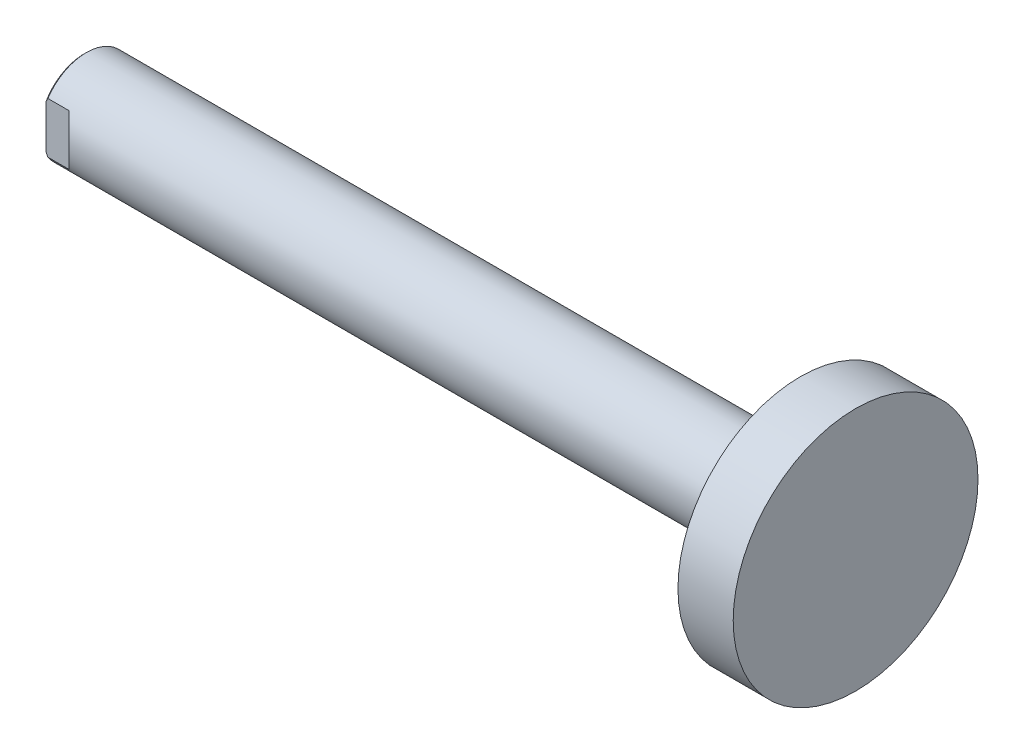
ISO-10303-21;
HEADER;
FILE_DESCRIPTION(('STEP AP214'),'2;1');
FILE_NAME('part.step','',(''),(''),'','','');
FILE_SCHEMA(('AUTOMOTIVE_DESIGN { 1 0 10303 214 1 1 1 1 }'));
ENDSEC;
DATA;
#1=APPLICATION_CONTEXT('core data for automotive mechanical design processes');
#2=APPLICATION_PROTOCOL_DEFINITION('international standard','automotive_design',2000,#1);
#3=PRODUCT_CONTEXT('',#1,'mechanical');
#4=PRODUCT('Part','Part','',(#3));
#5=PRODUCT_RELATED_PRODUCT_CATEGORY('part','',(#4));
#6=PRODUCT_DEFINITION_FORMATION('','',#4);
#7=PRODUCT_DEFINITION_CONTEXT('part definition',#1,'design');
#8=PRODUCT_DEFINITION('design','',#6,#7);
#9=PRODUCT_DEFINITION_SHAPE('','',#8);
#10=(LENGTH_UNIT() NAMED_UNIT(*) SI_UNIT(.MILLI.,.METRE.));
#11=(NAMED_UNIT(*) PLANE_ANGLE_UNIT() SI_UNIT($,.RADIAN.));
#12=(NAMED_UNIT(*) SI_UNIT($,.STERADIAN.) SOLID_ANGLE_UNIT());
#13=UNCERTAINTY_MEASURE_WITH_UNIT(LENGTH_MEASURE(1.E-05),#10,'distance_accuracy_value','');
#14=(GEOMETRIC_REPRESENTATION_CONTEXT(3) GLOBAL_UNCERTAINTY_ASSIGNED_CONTEXT((#13)) GLOBAL_UNIT_ASSIGNED_CONTEXT((#10,
#11,#12)) REPRESENTATION_CONTEXT('',''));
#15=CARTESIAN_POINT('',(0.,0.,0.));
#16=DIRECTION('',(0.,0.,1.));
#17=DIRECTION('',(1.,0.,0.));
#18=AXIS2_PLACEMENT_3D('',#15,#16,#17);
#19=CARTESIAN_POINT('',(7.40000000001828,0.,0.));
#20=DIRECTION('',(-1.,0.,0.));
#21=DIRECTION('',(0.,0.,1.));
#22=AXIS2_PLACEMENT_3D('',#19,#20,#21);
#23=CONICAL_SURFACE('',#22,2.45849999998882,1.04719755119439);
#24=CARTESIAN_POINT('',(8.81941563682176,0.,0.));
#25=VERTEX_POINT('',#24);
#26=VERTEX_LOOP('',#25);
#27=FACE_BOUND('',#26,.T.);
#28=CARTESIAN_POINT('',(7.4,0.,0.));
#29=DIRECTION('',(-1.,0.,0.));
#30=DIRECTION('',(0.,-1.,0.));
#31=AXIS2_PLACEMENT_3D('',#28,#29,#30);
#32=CIRCLE('',#31,2.4585);
#33=CARTESIAN_POINT('',(7.4,-2.4585,0.));
#34=VERTEX_POINT('',#33);
#35=EDGE_CURVE('E112',#34,#34,#32,.T.);
#36=ORIENTED_EDGE('',*,*,#35,.T.);
#37=EDGE_LOOP('',(#36));
#38=FACE_BOUND('',#37,.T.);
#39=ADVANCED_FACE('F16',(#27,#38),#23,.F.);
#40=CARTESIAN_POINT('',(8.8194156368027,0.,0.));
#41=DIRECTION('',(-1.,0.,0.));
#42=DIRECTION('',(0.,-1.,0.));
#43=AXIS2_PLACEMENT_3D('',#40,#41,#42);
#44=CYLINDRICAL_SURFACE('',#43,2.4585);
#45=CARTESIAN_POINT('',(-6.45850000006476,0.,0.));
#46=DIRECTION('',(-1.,0.,0.));
#47=DIRECTION('',(0.,-1.,0.));
#48=AXIS2_PLACEMENT_3D('',#45,#46,#47);
#49=CIRCLE('',#48,2.45849999998882);
#50=CARTESIAN_POINT('',(-6.45850000006476,-2.45849999998882,0.));
#51=VERTEX_POINT('',#50);
#52=EDGE_CURVE('E109',#51,#51,#49,.T.);
#53=ORIENTED_EDGE('',*,*,#52,.T.);
#54=EDGE_LOOP('',(#53));
#55=FACE_BOUND('',#54,.T.);
#56=ORIENTED_EDGE('',*,*,#35,.F.);
#57=EDGE_LOOP('',(#56));
#58=FACE_BOUND('',#57,.T.);
#59=ADVANCED_FACE('F176',(#55,#58),#44,.F.);
#60=CARTESIAN_POINT('',(93.5,15.95,0.));
#61=DIRECTION('',(-1.,0.,0.));
#62=DIRECTION('',(0.,0.,1.));
#63=AXIS2_PLACEMENT_3D('',#60,#61,#62);
#64=PLANE('',#63);
#65=CARTESIAN_POINT('',(93.5,0.,0.));
#66=DIRECTION('',(-1.,0.,0.));
#67=DIRECTION('',(0.,0.,1.));
#68=AXIS2_PLACEMENT_3D('',#65,#66,#67);
#69=CIRCLE('',#68,15.95);
#70=CARTESIAN_POINT('',(93.5,0.,15.95));
#71=VERTEX_POINT('',#70);
#72=EDGE_CURVE('E19',#71,#71,#69,.T.);
#73=ORIENTED_EDGE('',*,*,#72,.F.);
#74=EDGE_LOOP('',(#73));
#75=FACE_BOUND('',#74,.T.);
#76=ADVANCED_FACE('F173',(#75),#64,.F.);
#77=CARTESIAN_POINT('',(-7.000000000005,0.,0.));
#78=DIRECTION('',(-1.,0.,0.));
#79=DIRECTION('',(0.,0.,1.));
#80=AXIS2_PLACEMENT_3D('',#77,#78,#79);
#81=CONICAL_SURFACE('',#80,2.99999999992906,0.785398163397448);
#82=CARTESIAN_POINT('',(-7.000000000005,0.,0.));
#83=DIRECTION('',(-1.,0.,0.));
#84=DIRECTION('',(0.,0.,1.));
#85=AXIS2_PLACEMENT_3D('',#82,#83,#84);
#86=CIRCLE('',#85,2.99999999992906);
#87=CARTESIAN_POINT('',(-7.000000000005,0.,2.99999999992906));
#88=VERTEX_POINT('',#87);
#89=EDGE_CURVE('E201',#88,#88,#86,.T.);
#90=ORIENTED_EDGE('',*,*,#89,.T.);
#91=EDGE_LOOP('',(#90));
#92=FACE_BOUND('',#91,.T.);
#93=ORIENTED_EDGE('',*,*,#52,.F.);
#94=EDGE_LOOP('',(#93));
#95=FACE_BOUND('',#94,.T.);
#96=ADVANCED_FACE('F169',(#92,#95),#81,.F.);
#97=CARTESIAN_POINT('',(93.5,0.,0.));
#98=DIRECTION('',(-1.,0.,0.));
#99=DIRECTION('',(0.,0.,1.));
#100=AXIS2_PLACEMENT_3D('',#97,#98,#99);
#101=CYLINDRICAL_SURFACE('',#100,15.95);
#102=CARTESIAN_POINT('',(86.3,0.,0.));
#103=DIRECTION('',(-1.,0.,0.));
#104=DIRECTION('',(0.,0.,1.));
#105=AXIS2_PLACEMENT_3D('',#102,#103,#104);
#106=CIRCLE('',#105,15.95);
#107=CARTESIAN_POINT('',(86.3,0.,15.95));
#108=VERTEX_POINT('',#107);
#109=EDGE_CURVE('E80',#108,#108,#106,.F.);
#110=ORIENTED_EDGE('',*,*,#109,.T.);
#111=EDGE_LOOP('',(#110));
#112=FACE_BOUND('',#111,.T.);
#113=ORIENTED_EDGE('',*,*,#72,.T.);
#114=EDGE_LOOP('',(#113));
#115=FACE_BOUND('',#114,.T.);
#116=ADVANCED_FACE('F165',(#112,#115),#101,.T.);
#117=CARTESIAN_POINT('',(-7.,0.,0.));
#118=DIRECTION('',(1.,0.,0.));
#119=DIRECTION('',(0.,0.,-1.));
#120=AXIS2_PLACEMENT_3D('',#117,#118,#119);
#121=PLANE('',#120);
#122=ORIENTED_EDGE('',*,*,#89,.F.);
#123=EDGE_LOOP('',(#122));
#124=FACE_BOUND('',#123,.T.);
#125=DIRECTION('',(0.,1.,0.));
#126=VECTOR('',#125,1.);
#127=CARTESIAN_POINT('',(-7.,10.,-5.));
#128=LINE('',#127,#126);
#129=CARTESIAN_POINT('',(-6.99999999997408,-2.83945417291763,-5.));
#130=VERTEX_POINT('',#129);
#131=CARTESIAN_POINT('',(-6.99999999997408,2.83945417291763,-5.));
#132=VERTEX_POINT('',#131);
#133=EDGE_CURVE('E76',#130,#132,#128,.T.);
#134=ORIENTED_EDGE('',*,*,#133,.F.);
#135=CARTESIAN_POINT('',(-6.99999999994816,0.,0.));
#136=DIRECTION('',(1.,0.,0.));
#137=DIRECTION('',(0.,0.,-1.));
#138=AXIS2_PLACEMENT_3D('',#135,#136,#137);
#139=CIRCLE('',#138,5.75000000003456);
#140=CARTESIAN_POINT('',(-6.99999999996544,-2.83945417293513,5.));
#141=VERTEX_POINT('',#140);
#142=EDGE_CURVE('E69',#141,#130,#139,.T.);
#143=ORIENTED_EDGE('',*,*,#142,.F.);
#144=DIRECTION('',(0.,1.,0.));
#145=VECTOR('',#144,1.);
#146=CARTESIAN_POINT('',(-7.,10.,5.));
#147=LINE('',#146,#145);
#148=CARTESIAN_POINT('',(-6.99999999997408,2.83945417291763,5.));
#149=VERTEX_POINT('',#148);
#150=EDGE_CURVE('E74',#149,#141,#147,.F.);
#151=ORIENTED_EDGE('',*,*,#150,.F.);
#152=CARTESIAN_POINT('',(-6.99999999994816,0.,0.));
#153=DIRECTION('',(1.,0.,0.));
#154=DIRECTION('',(0.,0.,-1.));
#155=AXIS2_PLACEMENT_3D('',#152,#153,#154);
#156=CIRCLE('',#155,5.75000000003456);
#157=EDGE_CURVE('E89',#132,#149,#156,.T.);
#158=ORIENTED_EDGE('',*,*,#157,.F.);
#159=EDGE_LOOP('',(#134,#143,#151,#158));
#160=FACE_BOUND('',#159,.T.);
#161=ADVANCED_FACE('F71',(#124,#160),#121,.F.);
#162=CARTESIAN_POINT('',(86.3,6.,0.));
#163=DIRECTION('',(1.,0.,0.));
#164=DIRECTION('',(0.,0.,-1.));
#165=AXIS2_PLACEMENT_3D('',#162,#163,#164);
#166=PLANE('',#165);
#167=CARTESIAN_POINT('',(86.3,0.,0.));
#168=DIRECTION('',(-1.,0.,0.));
#169=DIRECTION('',(0.,0.,1.));
#170=AXIS2_PLACEMENT_3D('',#167,#168,#169);
#171=CIRCLE('',#170,6.);
#172=CARTESIAN_POINT('',(86.3,0.,6.));
#173=VERTEX_POINT('',#172);
#174=EDGE_CURVE('E93',#173,#173,#171,.T.);
#175=ORIENTED_EDGE('',*,*,#174,.F.);
#176=EDGE_LOOP('',(#175));
#177=FACE_BOUND('',#176,.T.);
#178=ORIENTED_EDGE('',*,*,#109,.F.);
#179=EDGE_LOOP('',(#178));
#180=FACE_BOUND('',#179,.T.);
#181=ADVANCED_FACE('F158',(#177,#180),#166,.F.);
#182=CARTESIAN_POINT('',(-6.75000000001091,0.,0.));
#183=DIRECTION('',(1.,0.,0.));
#184=DIRECTION('',(0.,0.,-1.));
#185=AXIS2_PLACEMENT_3D('',#182,#183,#184);
#186=CONICAL_SURFACE('',#185,5.99999999991496,0.785398163283761);
#187=CARTESIAN_POINT('',(-6.74999999995025,-3.3166247903279,-5.00000000001579));
#188=CARTESIAN_POINT('',(-6.77172046964819,-3.27733056165755,-5.0000000000057));
#189=CARTESIAN_POINT('',(-6.79323610499812,-3.23792278957236,-5.00000000000154));
#190=CARTESIAN_POINT('',(-6.83583018649129,-3.15887852904057,-4.99999999999847));
#191=CARTESIAN_POINT('',(-6.8569086906853,-3.11924207186846,-4.99999999999956));
#192=CARTESIAN_POINT('',(-6.89860699729288,-3.03972795186191,-5.00000000000044));
#193=CARTESIAN_POINT('',(-6.91922679555983,-2.99985028685113,-5.00000000000022));
#194=CARTESIAN_POINT('',(-6.95998326371193,-2.91984217525212,-4.99999999999978));
#195=CARTESIAN_POINT('',(-6.98011986864161,-2.87971169558349,-4.99999999999956));
#196=CARTESIAN_POINT('',(-6.99999999998277,-2.83945417290017,-5.));
#197=B_SPLINE_CURVE_WITH_KNOTS('',3,(#187,#188,#189,#190,#191,#192,#193,#194,#195,#196),
.UNSPECIFIED.,.F.,.F.,(4,2,2,2,4),(0.,0.134693282500561,0.269368561764464,0.40404505797675,
0.538739558403284),.UNSPECIFIED.);
#198=CARTESIAN_POINT('',(-6.74999999997161,-3.31662479033971,-5.));
#199=VERTEX_POINT('',#198);
#200=EDGE_CURVE('E104',#199,#130,#197,.T.);
#201=ORIENTED_EDGE('',*,*,#200,.F.);
#202=CARTESIAN_POINT('',(-6.75,0.,0.));
#203=DIRECTION('',(-1.,0.,0.));
#204=DIRECTION('',(0.,0.,1.));
#205=AXIS2_PLACEMENT_3D('',#202,#203,#204);
#206=CIRCLE('',#205,6.);
#207=CARTESIAN_POINT('',(-6.74999999997161,-3.31662479033971,5.));
#208=VERTEX_POINT('',#207);
#209=EDGE_CURVE('E86',#208,#199,#206,.F.);
#210=ORIENTED_EDGE('',*,*,#209,.F.);
#211=CARTESIAN_POINT('',(-6.99999999998272,-2.83945417290014,5.));
#212=CARTESIAN_POINT('',(-6.98011986864177,-2.87971169558361,5.));
#213=CARTESIAN_POINT('',(-6.959983263712,-2.91984217525221,5.));
#214=CARTESIAN_POINT('',(-6.9192267955597,-2.99985028685115,5.));
#215=CARTESIAN_POINT('',(-6.89860699729265,-3.03972795186188,5.));
#216=CARTESIAN_POINT('',(-6.85690869068543,-3.11924207186868,5.));
#217=CARTESIAN_POINT('',(-6.8358301864919,-3.15887852904109,5.));
#218=CARTESIAN_POINT('',(-6.79323610499732,-3.2379227895722,5.));
#219=CARTESIAN_POINT('',(-6.77172046964552,-3.27733056165642,5.));
#220=CARTESIAN_POINT('',(-6.74999999994307,-3.31662479032435,5.));
#221=B_SPLINE_CURVE_WITH_KNOTS('',3,(#211,#212,#213,#214,#215,#216,#217,#218,#219,#220),
.UNSPECIFIED.,.F.,.F.,(4,2,2,2,4),(0.,0.134694500426608,0.26937099663892,0.404046275902917,
0.538739558403616),.UNSPECIFIED.);
#222=EDGE_CURVE('E83',#141,#208,#221,.T.);
#223=ORIENTED_EDGE('',*,*,#222,.F.);
#224=ORIENTED_EDGE('',*,*,#142,.T.);
#225=EDGE_LOOP('',(#201,#210,#223,#224));
#226=FACE_BOUND('',#225,.T.);
#227=ADVANCED_FACE('F84',(#226),#186,.T.);
#228=CARTESIAN_POINT('',(-4.,10.,-5.));
#229=DIRECTION('',(-0.707106781186548,0.,-0.707106781186548));
#230=DIRECTION('',(-0.707106781186548,0.,0.707106781186548));
#231=AXIS2_PLACEMENT_3D('',#228,#229,#230);
#232=PLANE('',#231);
#233=CARTESIAN_POINT('',(-9.,0.,0.));
#234=DIRECTION('',(-0.707106781186548,0.,-0.707106781186548));
#235=DIRECTION('',(-0.707106781186548,0.,0.707106781186548));
#236=AXIS2_PLACEMENT_3D('',#233,#234,#235);
#237=ELLIPSE('',#236,8.48528137423857,6.);
#238=CARTESIAN_POINT('',(-4.,-3.3166247903554,-5.));
#239=VERTEX_POINT('',#238);
#240=CARTESIAN_POINT('',(-4.,3.3166247903554,-5.));
#241=VERTEX_POINT('',#240);
#242=EDGE_CURVE('E119',#239,#241,#237,.F.);
#243=ORIENTED_EDGE('',*,*,#242,.F.);
#244=DIRECTION('',(0.,1.,0.));
#245=VECTOR('',#244,1.);
#246=CARTESIAN_POINT('',(-4.,10.,-5.));
#247=LINE('',#246,#245);
#248=EDGE_CURVE('E79',#241,#239,#247,.F.);
#249=ORIENTED_EDGE('',*,*,#248,.F.);
#250=EDGE_LOOP('',(#243,#249));
#251=FACE_BOUND('',#250,.T.);
#252=ADVANCED_FACE('F157',(#251),#232,.T.);
#253=CARTESIAN_POINT('',(-7.,10.,-5.));
#254=DIRECTION('',(0.,0.,-1.));
#255=DIRECTION('',(-1.,0.,0.));
#256=AXIS2_PLACEMENT_3D('',#253,#254,#255);
#257=PLANE('',#256);
#258=ORIENTED_EDGE('',*,*,#200,.T.);
#259=ORIENTED_EDGE('',*,*,#133,.T.);
#260=CARTESIAN_POINT('',(-6.74999999994219,3.31662479032589,-5.));
#261=CARTESIAN_POINT('',(-6.77172046964462,3.27733056165803,-5.));
#262=CARTESIAN_POINT('',(-6.7932361049964,3.23792278957388,-5.));
#263=CARTESIAN_POINT('',(-6.83583018649093,3.1588785290429,-5.));
#264=CARTESIAN_POINT('',(-6.85690869068444,3.11924207187056,-5.));
#265=CARTESIAN_POINT('',(-6.8986069972916,3.03972795186389,-5.));
#266=CARTESIAN_POINT('',(-6.91922679555862,2.99985028685322,-5.));
#267=CARTESIAN_POINT('',(-6.95998326371089,2.91984217525443,-5.));
#268=CARTESIAN_POINT('',(-6.98011986864065,2.8797116955859,-5.));
#269=CARTESIAN_POINT('',(-6.99999999998161,2.83945417290251,-5.));
#270=B_SPLINE_CURVE_WITH_KNOTS('',3,(#260,#261,#262,#263,#264,#265,#266,#267,#268,#269),
.UNSPECIFIED.,.F.,.F.,(4,2,2,2,4),(0.,0.134693282500488,0.269368561764273,0.404045057976373,
0.538739558402769),.UNSPECIFIED.);
#271=CARTESIAN_POINT('',(-6.74999999997109,3.31662479034065,-5.));
#272=VERTEX_POINT('',#271);
#273=EDGE_CURVE('E103',#272,#132,#270,.T.);
#274=ORIENTED_EDGE('',*,*,#273,.F.);
#275=DIRECTION('',(-1.,0.,0.));
#276=VECTOR('',#275,1.);
#277=CARTESIAN_POINT('',(0.,3.3166247903554,-5.));
#278=LINE('',#277,#276);
#279=EDGE_CURVE('E101',#241,#272,#278,.T.);
#280=ORIENTED_EDGE('',*,*,#279,.F.);
#281=ORIENTED_EDGE('',*,*,#248,.T.);
#282=DIRECTION('',(-1.,0.,0.));
#283=VECTOR('',#282,1.);
#284=CARTESIAN_POINT('',(0.,-3.3166247903554,-5.));
#285=LINE('',#284,#283);
#286=EDGE_CURVE('E107',#199,#239,#285,.F.);
#287=ORIENTED_EDGE('',*,*,#286,.F.);
#288=EDGE_LOOP('',(#258,#259,#274,#280,#281,#287));
#289=FACE_BOUND('',#288,.T.);
#290=ADVANCED_FACE('F139',(#289),#257,.T.);
#291=CARTESIAN_POINT('',(-6.75000000001091,0.,0.));
#292=DIRECTION('',(1.,0.,0.));
#293=DIRECTION('',(0.,0.,-1.));
#294=AXIS2_PLACEMENT_3D('',#291,#292,#293);
#295=CONICAL_SURFACE('',#294,5.99999999991496,0.785398163283761);
#296=CARTESIAN_POINT('',(-6.74999999995025,3.3166247903279,5.00000000001579));
#297=CARTESIAN_POINT('',(-6.77172046964819,3.27733056165755,5.0000000000057));
#298=CARTESIAN_POINT('',(-6.79323610499812,3.23792278957236,5.00000000000154));
#299=CARTESIAN_POINT('',(-6.83583018649129,3.15887852904057,4.99999999999847));
#300=CARTESIAN_POINT('',(-6.8569086906853,3.11924207186846,4.99999999999956));
#301=CARTESIAN_POINT('',(-6.89860699729288,3.03972795186191,5.00000000000044));
#302=CARTESIAN_POINT('',(-6.91922679555983,2.99985028685113,5.00000000000022));
#303=CARTESIAN_POINT('',(-6.95998326371193,2.91984217525212,4.99999999999978));
#304=CARTESIAN_POINT('',(-6.98011986864161,2.87971169558349,4.99999999999956));
#305=CARTESIAN_POINT('',(-6.99999999998277,2.83945417290017,5.));
#306=B_SPLINE_CURVE_WITH_KNOTS('',3,(#296,#297,#298,#299,#300,#301,#302,#303,#304,#305),
.UNSPECIFIED.,.F.,.F.,(4,2,2,2,4),(0.,0.134693282500562,0.269368561764464,0.404045057976751,
0.538739558403285),.UNSPECIFIED.);
#307=CARTESIAN_POINT('',(-6.74999999997161,3.31662479033971,5.));
#308=VERTEX_POINT('',#307);
#309=EDGE_CURVE('E88',#308,#149,#306,.T.);
#310=ORIENTED_EDGE('',*,*,#309,.F.);
#311=CARTESIAN_POINT('',(-6.75,0.,0.));
#312=DIRECTION('',(-1.,0.,0.));
#313=DIRECTION('',(0.,0.,1.));
#314=AXIS2_PLACEMENT_3D('',#311,#312,#313);
#315=CIRCLE('',#314,6.);
#316=EDGE_CURVE('E98',#272,#308,#315,.F.);
#317=ORIENTED_EDGE('',*,*,#316,.F.);
#318=ORIENTED_EDGE('',*,*,#273,.T.);
#319=ORIENTED_EDGE('',*,*,#157,.T.);
#320=EDGE_LOOP('',(#310,#317,#318,#319));
#321=FACE_BOUND('',#320,.T.);
#322=ADVANCED_FACE('F135',(#321),#295,.T.);
#323=CARTESIAN_POINT('',(-4.,10.,5.));
#324=DIRECTION('',(0.,0.,1.));
#325=DIRECTION('',(1.,0.,0.));
#326=AXIS2_PLACEMENT_3D('',#323,#324,#325);
#327=PLANE('',#326);
#328=ORIENTED_EDGE('',*,*,#309,.T.);
#329=ORIENTED_EDGE('',*,*,#150,.T.);
#330=ORIENTED_EDGE('',*,*,#222,.T.);
#331=DIRECTION('',(-1.,0.,0.));
#332=VECTOR('',#331,1.);
#333=CARTESIAN_POINT('',(0.,-3.3166247903554,5.));
#334=LINE('',#333,#332);
#335=CARTESIAN_POINT('',(-4.,-3.3166247903554,5.));
#336=VERTEX_POINT('',#335);
#337=EDGE_CURVE('E108',#336,#208,#334,.T.);
#338=ORIENTED_EDGE('',*,*,#337,.F.);
#339=DIRECTION('',(0.,1.,0.));
#340=VECTOR('',#339,1.);
#341=CARTESIAN_POINT('',(-4.,10.,5.));
#342=LINE('',#341,#340);
#343=CARTESIAN_POINT('',(-4.,3.3166247903554,5.));
#344=VERTEX_POINT('',#343);
#345=EDGE_CURVE('E34',#344,#336,#342,.F.);
#346=ORIENTED_EDGE('',*,*,#345,.F.);
#347=DIRECTION('',(-1.,0.,0.));
#348=VECTOR('',#347,1.);
#349=CARTESIAN_POINT('',(0.,3.3166247903554,5.));
#350=LINE('',#349,#348);
#351=EDGE_CURVE('E25',#308,#344,#350,.F.);
#352=ORIENTED_EDGE('',*,*,#351,.F.);
#353=EDGE_LOOP('',(#328,#329,#330,#338,#346,#352));
#354=FACE_BOUND('',#353,.T.);
#355=ADVANCED_FACE('F91',(#354),#327,.T.);
#356=CARTESIAN_POINT('',(1.,10.,10.));
#357=DIRECTION('',(-0.707106781186548,0.,0.707106781186548));
#358=DIRECTION('',(0.707106781186548,0.,0.707106781186548));
#359=AXIS2_PLACEMENT_3D('',#356,#357,#358);
#360=PLANE('',#359);
#361=CARTESIAN_POINT('',(-9.,0.,0.));
#362=DIRECTION('',(-0.707106781186548,0.,0.707106781186548));
#363=DIRECTION('',(-0.707106781186548,0.,-0.707106781186548));
#364=AXIS2_PLACEMENT_3D('',#361,#362,#363);
#365=ELLIPSE('',#364,8.48528137423857,6.);
#366=EDGE_CURVE('E10',#344,#336,#365,.F.);
#367=ORIENTED_EDGE('',*,*,#366,.F.);
#368=ORIENTED_EDGE('',*,*,#345,.T.);
#369=EDGE_LOOP('',(#367,#368));
#370=FACE_BOUND('',#369,.T.);
#371=ADVANCED_FACE('F188',(#370),#360,.T.);
#372=CARTESIAN_POINT('',(0.,0.,0.));
#373=DIRECTION('',(-1.,0.,0.));
#374=DIRECTION('',(0.,0.,1.));
#375=AXIS2_PLACEMENT_3D('',#372,#373,#374);
#376=CYLINDRICAL_SURFACE('',#375,6.);
#377=ORIENTED_EDGE('',*,*,#351,.T.);
#378=ORIENTED_EDGE('',*,*,#366,.T.);
#379=ORIENTED_EDGE('',*,*,#337,.T.);
#380=ORIENTED_EDGE('',*,*,#209,.T.);
#381=ORIENTED_EDGE('',*,*,#286,.T.);
#382=ORIENTED_EDGE('',*,*,#242,.T.);
#383=ORIENTED_EDGE('',*,*,#279,.T.);
#384=ORIENTED_EDGE('',*,*,#316,.T.);
#385=EDGE_LOOP('',(#377,#378,#379,#380,#381,#382,#383,#384));
#386=FACE_BOUND('',#385,.T.);
#387=ORIENTED_EDGE('',*,*,#174,.T.);
#388=EDGE_LOOP('',(#387));
#389=FACE_BOUND('',#388,.T.);
#390=ADVANCED_FACE('F186',(#386,#389),#376,.T.);
#391=CLOSED_SHELL('',(#39,#59,#76,#96,#116,#161,#181,#227,#252,#290,#322,#355,#371,#390));
#392=MANIFOLD_SOLID_BREP('B1',#391);
#393=ADVANCED_BREP_SHAPE_REPRESENTATION('',(#18,#392),#14);
#394=SHAPE_DEFINITION_REPRESENTATION(#9,#393);
ENDSEC;
END-ISO-10303-21;
